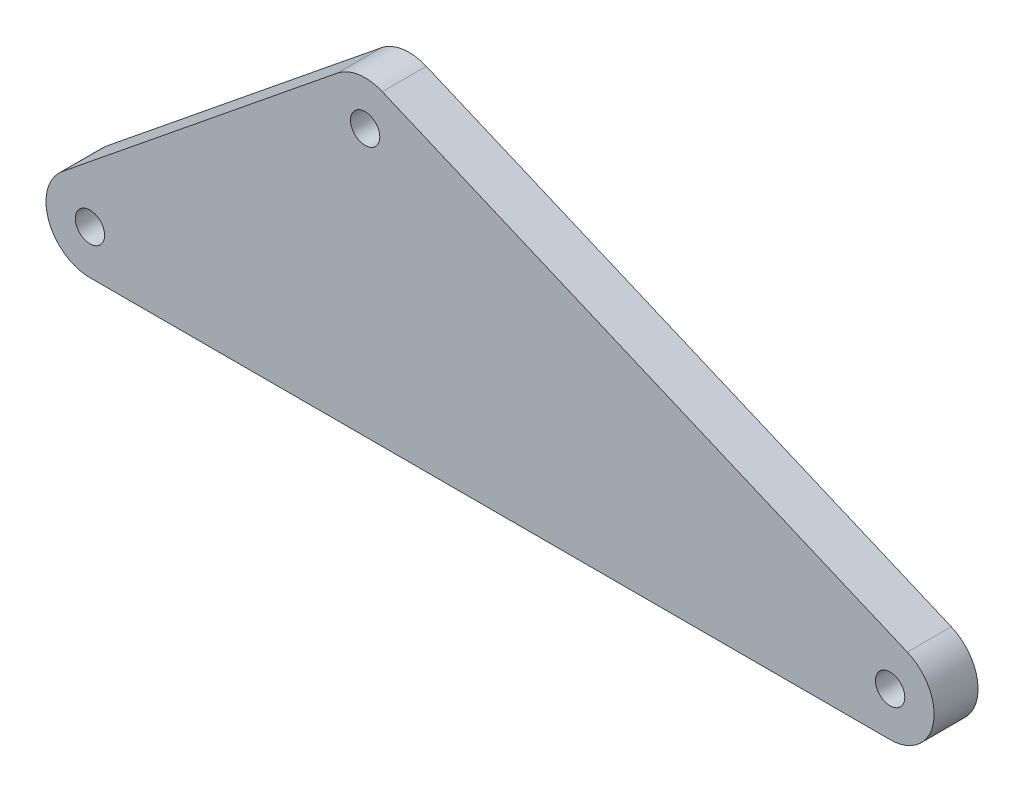
ISO-10303-21;
HEADER;
FILE_DESCRIPTION(('STEP AP214'),'2;1');
FILE_NAME('part.step','',(''),(''),'','','');
FILE_SCHEMA(('AUTOMOTIVE_DESIGN { 1 0 10303 214 1 1 1 1 }'));
ENDSEC;
DATA;
#1=APPLICATION_CONTEXT('core data for automotive mechanical design processes');
#2=APPLICATION_PROTOCOL_DEFINITION('international standard','automotive_design',2000,#1);
#3=PRODUCT_CONTEXT('',#1,'mechanical');
#4=PRODUCT('Part','Part','',(#3));
#5=PRODUCT_RELATED_PRODUCT_CATEGORY('part','',(#4));
#6=PRODUCT_DEFINITION_FORMATION('','',#4);
#7=PRODUCT_DEFINITION_CONTEXT('part definition',#1,'design');
#8=PRODUCT_DEFINITION('design','',#6,#7);
#9=PRODUCT_DEFINITION_SHAPE('','',#8);
#10=(LENGTH_UNIT() NAMED_UNIT(*) SI_UNIT(.MILLI.,.METRE.));
#11=(NAMED_UNIT(*) PLANE_ANGLE_UNIT() SI_UNIT($,.RADIAN.));
#12=(NAMED_UNIT(*) SI_UNIT($,.STERADIAN.) SOLID_ANGLE_UNIT());
#13=UNCERTAINTY_MEASURE_WITH_UNIT(LENGTH_MEASURE(1.E-05),#10,'distance_accuracy_value','');
#14=(GEOMETRIC_REPRESENTATION_CONTEXT(3) GLOBAL_UNCERTAINTY_ASSIGNED_CONTEXT((#13)) GLOBAL_UNIT_ASSIGNED_CONTEXT((#10,
#11,#12)) REPRESENTATION_CONTEXT('',''));
#15=CARTESIAN_POINT('',(0.,0.,0.));
#16=DIRECTION('',(0.,0.,1.));
#17=DIRECTION('',(1.,0.,0.));
#18=AXIS2_PLACEMENT_3D('',#15,#16,#17);
#19=CARTESIAN_POINT('',(-358.224761635496,152.05738985696,15.));
#20=DIRECTION('',(0.,0.,-1.));
#21=DIRECTION('',(-1.,0.,0.));
#22=AXIS2_PLACEMENT_3D('',#19,#20,#21);
#23=CYLINDRICAL_SURFACE('',#22,9.99999999999998);
#24=CARTESIAN_POINT('',(-358.224761635496,152.05738985696,15.));
#25=DIRECTION('',(0.,0.,1.));
#26=DIRECTION('',(1.,0.,0.));
#27=AXIS2_PLACEMENT_3D('',#24,#25,#26);
#28=CIRCLE('',#27,9.99999999999998);
#29=CARTESIAN_POINT('',(-348.224761635496,152.05738985696,15.));
#30=VERTEX_POINT('',#29);
#31=EDGE_CURVE('E126',#30,#30,#28,.T.);
#32=ORIENTED_EDGE('',*,*,#31,.T.);
#33=EDGE_LOOP('',(#32));
#34=FACE_BOUND('',#33,.T.);
#35=CARTESIAN_POINT('',(-358.224761635496,152.05738985696,-2.));
#36=DIRECTION('',(0.,0.,-1.));
#37=DIRECTION('',(-1.,0.,0.));
#38=AXIS2_PLACEMENT_3D('',#35,#36,#37);
#39=CIRCLE('',#38,9.99999999999998);
#40=CARTESIAN_POINT('',(-368.224761635496,152.05738985696,-2.));
#41=VERTEX_POINT('',#40);
#42=EDGE_CURVE('E39',#41,#41,#39,.T.);
#43=ORIENTED_EDGE('',*,*,#42,.T.);
#44=EDGE_LOOP('',(#43));
#45=FACE_BOUND('',#44,.T.);
#46=ADVANCED_FACE('F35',(#34,#45),#23,.F.);
#47=CARTESIAN_POINT('',(-358.224761635496,152.05738985696,15.));
#48=DIRECTION('',(0.,0.,-1.));
#49=DIRECTION('',(-1.,0.,0.));
#50=AXIS2_PLACEMENT_3D('',#47,#48,#49);
#51=PLANE('',#50);
#52=CARTESIAN_POINT('',(-358.224761635496,152.05738985696,15.));
#53=DIRECTION('',(0.,0.,1.));
#54=DIRECTION('',(-1.,0.,0.));
#55=AXIS2_PLACEMENT_3D('',#52,#53,#54);
#56=CIRCLE('',#55,30.);
#57=CARTESIAN_POINT('',(-346.502827780818,179.672535460533,15.));
#58=VERTEX_POINT('',#57);
#59=CARTESIAN_POINT('',(-377.104373366991,175.371768700669,15.));
#60=VERTEX_POINT('',#59);
#61=EDGE_CURVE('E133',#58,#60,#56,.T.);
#62=ORIENTED_EDGE('',*,*,#61,.T.);
#63=DIRECTION('',(-0.777145961456974,-0.629320391049833,0.));
#64=VECTOR('',#63,1.);
#65=CARTESIAN_POINT('',(-564.879611731495,23.3143788437092,15.));
#66=LINE('',#65,#64);
#67=CARTESIAN_POINT('',(-564.879611731495,23.3143788437093,15.));
#68=VERTEX_POINT('',#67);
#69=EDGE_CURVE('E90',#60,#68,#66,.T.);
#70=ORIENTED_EDGE('',*,*,#69,.T.);
#71=CARTESIAN_POINT('',(-546.,1.11022302462516E-13,15.));
#72=DIRECTION('',(0.,0.,1.));
#73=DIRECTION('',(-1.,0.,0.));
#74=AXIS2_PLACEMENT_3D('',#71,#72,#73);
#75=CIRCLE('',#74,29.9999999999999);
#76=CARTESIAN_POINT('',(-546.,-29.9999999999999,15.));
#77=VERTEX_POINT('',#76);
#78=EDGE_CURVE('E104',#68,#77,#75,.T.);
#79=ORIENTED_EDGE('',*,*,#78,.T.);
#80=DIRECTION('',(1.,0.,0.));
#81=VECTOR('',#80,1.);
#82=CARTESIAN_POINT('',(0.,-29.9999999999997,15.));
#83=LINE('',#82,#81);
#84=CARTESIAN_POINT('',(0.,-29.9999999999999,15.));
#85=VERTEX_POINT('',#84);
#86=EDGE_CURVE('E97',#77,#85,#83,.T.);
#87=ORIENTED_EDGE('',*,*,#86,.T.);
#88=CARTESIAN_POINT('',(0.,0.,15.));
#89=DIRECTION('',(0.,0.,1.));
#90=DIRECTION('',(-1.,0.,0.));
#91=AXIS2_PLACEMENT_3D('',#88,#89,#90);
#92=CIRCLE('',#91,29.9999999999999);
#93=CARTESIAN_POINT('',(11.7219338546786,27.6151456035733,15.));
#94=VERTEX_POINT('',#93);
#95=EDGE_CURVE('E102',#85,#94,#92,.T.);
#96=ORIENTED_EDGE('',*,*,#95,.T.);
#97=DIRECTION('',(-0.920504853452437,0.390731128489281,0.));
#98=VECTOR('',#97,1.);
#99=CARTESIAN_POINT('',(-346.502827780818,179.672535460533,15.));
#100=LINE('',#99,#98);
#101=EDGE_CURVE('E53',#94,#58,#100,.T.);
#102=ORIENTED_EDGE('',*,*,#101,.T.);
#103=EDGE_LOOP('',(#62,#70,#79,#87,#96,#102));
#104=FACE_BOUND('',#103,.T.);
#105=ORIENTED_EDGE('',*,*,#31,.F.);
#106=EDGE_LOOP('',(#105));
#107=FACE_BOUND('',#106,.T.);
#108=CARTESIAN_POINT('',(0.,0.,15.));
#109=DIRECTION('',(0.,0.,1.));
#110=DIRECTION('',(1.,0.,0.));
#111=AXIS2_PLACEMENT_3D('',#108,#109,#110);
#112=CIRCLE('',#111,9.99999999999998);
#113=CARTESIAN_POINT('',(9.99999999999998,0.,15.));
#114=VERTEX_POINT('',#113);
#115=EDGE_CURVE('E187',#114,#114,#112,.T.);
#116=ORIENTED_EDGE('',*,*,#115,.F.);
#117=EDGE_LOOP('',(#116));
#118=FACE_BOUND('',#117,.T.);
#119=CARTESIAN_POINT('',(-546.,1.11022302462516E-13,15.));
#120=DIRECTION('',(0.,0.,1.));
#121=DIRECTION('',(1.,0.,0.));
#122=AXIS2_PLACEMENT_3D('',#119,#120,#121);
#123=CIRCLE('',#122,9.99999999999998);
#124=CARTESIAN_POINT('',(-536.,1.11022302462516E-13,15.));
#125=VERTEX_POINT('',#124);
#126=EDGE_CURVE('E188',#125,#125,#123,.T.);
#127=ORIENTED_EDGE('',*,*,#126,.F.);
#128=EDGE_LOOP('',(#127));
#129=FACE_BOUND('',#128,.T.);
#130=ADVANCED_FACE('F99',(#104,#107,#118,#129),#51,.F.);
#131=CARTESIAN_POINT('',(-358.224761635496,152.05738985696,-15.));
#132=DIRECTION('',(0.,0.,-1.));
#133=DIRECTION('',(-1.,0.,0.));
#134=AXIS2_PLACEMENT_3D('',#131,#132,#133);
#135=PLANE('',#134);
#136=CARTESIAN_POINT('',(-358.224761635496,152.05738985696,-15.));
#137=DIRECTION('',(0.,0.,-1.));
#138=DIRECTION('',(-1.,0.,0.));
#139=AXIS2_PLACEMENT_3D('',#136,#137,#138);
#140=CIRCLE('',#139,20.);
#141=CARTESIAN_POINT('',(-378.224761635496,152.05738985696,-15.));
#142=VERTEX_POINT('',#141);
#143=EDGE_CURVE('E182',#142,#142,#140,.T.);
#144=ORIENTED_EDGE('',*,*,#143,.F.);
#145=EDGE_LOOP('',(#144));
#146=FACE_BOUND('',#145,.T.);
#147=CARTESIAN_POINT('',(0.,0.,-15.));
#148=DIRECTION('',(0.,0.,1.));
#149=DIRECTION('',(1.,0.,0.));
#150=AXIS2_PLACEMENT_3D('',#147,#148,#149);
#151=CIRCLE('',#150,9.99999999999998);
#152=CARTESIAN_POINT('',(9.99999999999998,0.,-15.));
#153=VERTEX_POINT('',#152);
#154=EDGE_CURVE('E185',#153,#153,#151,.T.);
#155=ORIENTED_EDGE('',*,*,#154,.T.);
#156=EDGE_LOOP('',(#155));
#157=FACE_BOUND('',#156,.T.);
#158=CARTESIAN_POINT('',(-358.224761635496,152.05738985696,-15.));
#159=DIRECTION('',(0.,0.,1.));
#160=DIRECTION('',(-1.,0.,0.));
#161=AXIS2_PLACEMENT_3D('',#158,#159,#160);
#162=CIRCLE('',#161,30.);
#163=CARTESIAN_POINT('',(-346.502827780818,179.672535460533,-15.));
#164=VERTEX_POINT('',#163);
#165=CARTESIAN_POINT('',(-377.104373366991,175.371768700669,-15.));
#166=VERTEX_POINT('',#165);
#167=EDGE_CURVE('E122',#164,#166,#162,.T.);
#168=ORIENTED_EDGE('',*,*,#167,.F.);
#169=DIRECTION('',(-0.920504853452437,0.390731128489281,0.));
#170=VECTOR('',#169,1.);
#171=CARTESIAN_POINT('',(-346.502827780818,179.672535460533,-15.));
#172=LINE('',#171,#170);
#173=CARTESIAN_POINT('',(11.7219338546786,27.6151456035733,-15.));
#174=VERTEX_POINT('',#173);
#175=EDGE_CURVE('E82',#174,#164,#172,.T.);
#176=ORIENTED_EDGE('',*,*,#175,.F.);
#177=CARTESIAN_POINT('',(0.,0.,-15.));
#178=DIRECTION('',(0.,0.,1.));
#179=DIRECTION('',(-1.,0.,0.));
#180=AXIS2_PLACEMENT_3D('',#177,#178,#179);
#181=CIRCLE('',#180,29.9999999999999);
#182=CARTESIAN_POINT('',(0.,-29.9999999999999,-15.));
#183=VERTEX_POINT('',#182);
#184=EDGE_CURVE('E76',#183,#174,#181,.T.);
#185=ORIENTED_EDGE('',*,*,#184,.F.);
#186=DIRECTION('',(1.,0.,0.));
#187=VECTOR('',#186,1.);
#188=CARTESIAN_POINT('',(0.,-29.9999999999997,-15.));
#189=LINE('',#188,#187);
#190=CARTESIAN_POINT('',(-546.,-29.9999999999999,-15.));
#191=VERTEX_POINT('',#190);
#192=EDGE_CURVE('E112',#191,#183,#189,.T.);
#193=ORIENTED_EDGE('',*,*,#192,.F.);
#194=CARTESIAN_POINT('',(-546.,1.11022302462516E-13,-15.));
#195=DIRECTION('',(0.,0.,1.));
#196=DIRECTION('',(-1.,0.,0.));
#197=AXIS2_PLACEMENT_3D('',#194,#195,#196);
#198=CIRCLE('',#197,29.9999999999999);
#199=CARTESIAN_POINT('',(-564.879611731495,23.3143788437093,-15.));
#200=VERTEX_POINT('',#199);
#201=EDGE_CURVE('E128',#200,#191,#198,.T.);
#202=ORIENTED_EDGE('',*,*,#201,.F.);
#203=DIRECTION('',(-0.777145961456974,-0.629320391049833,0.));
#204=VECTOR('',#203,1.);
#205=CARTESIAN_POINT('',(-564.879611731495,23.3143788437092,-15.));
#206=LINE('',#205,#204);
#207=EDGE_CURVE('E125',#166,#200,#206,.T.);
#208=ORIENTED_EDGE('',*,*,#207,.F.);
#209=EDGE_LOOP('',(#168,#176,#185,#193,#202,#208));
#210=FACE_BOUND('',#209,.T.);
#211=CARTESIAN_POINT('',(-546.,1.11022302462516E-13,-15.));
#212=DIRECTION('',(0.,0.,1.));
#213=DIRECTION('',(1.,0.,0.));
#214=AXIS2_PLACEMENT_3D('',#211,#212,#213);
#215=CIRCLE('',#214,9.99999999999998);
#216=CARTESIAN_POINT('',(-536.,1.11022302462516E-13,-15.));
#217=VERTEX_POINT('',#216);
#218=EDGE_CURVE('E193',#217,#217,#215,.T.);
#219=ORIENTED_EDGE('',*,*,#218,.T.);
#220=EDGE_LOOP('',(#219));
#221=FACE_BOUND('',#220,.T.);
#222=ADVANCED_FACE('F143',(#146,#157,#210,#221),#135,.T.);
#223=CARTESIAN_POINT('',(-358.224761635496,152.05738985696,15.));
#224=DIRECTION('',(0.,0.,-1.));
#225=DIRECTION('',(-1.,0.,0.));
#226=AXIS2_PLACEMENT_3D('',#223,#224,#225);
#227=CYLINDRICAL_SURFACE('',#226,30.);
#228=ORIENTED_EDGE('',*,*,#167,.T.);
#229=DIRECTION('',(0.,0.,-1.));
#230=VECTOR('',#229,1.);
#231=CARTESIAN_POINT('',(-377.104373366991,175.371768700669,15.));
#232=LINE('',#231,#230);
#233=EDGE_CURVE('E11',#60,#166,#232,.T.);
#234=ORIENTED_EDGE('',*,*,#233,.F.);
#235=ORIENTED_EDGE('',*,*,#61,.F.);
#236=DIRECTION('',(0.,0.,-1.));
#237=VECTOR('',#236,1.);
#238=CARTESIAN_POINT('',(-346.502827780818,179.672535460533,15.));
#239=LINE('',#238,#237);
#240=EDGE_CURVE('E118',#58,#164,#239,.T.);
#241=ORIENTED_EDGE('',*,*,#240,.T.);
#242=EDGE_LOOP('',(#228,#234,#235,#241));
#243=FACE_BOUND('',#242,.T.);
#244=ADVANCED_FACE('F37',(#243),#227,.T.);
#245=CARTESIAN_POINT('',(-564.879611731495,23.3143788437092,15.));
#246=DIRECTION('',(0.629320391049833,-0.777145961456974,0.));
#247=DIRECTION('',(0.777145961456974,0.629320391049833,0.));
#248=AXIS2_PLACEMENT_3D('',#245,#246,#247);
#249=PLANE('',#248);
#250=ORIENTED_EDGE('',*,*,#207,.T.);
#251=DIRECTION('',(0.,0.,-1.));
#252=VECTOR('',#251,1.);
#253=CARTESIAN_POINT('',(-564.879611731495,23.3143788437093,15.));
#254=LINE('',#253,#252);
#255=EDGE_CURVE('E45',#68,#200,#254,.T.);
#256=ORIENTED_EDGE('',*,*,#255,.F.);
#257=ORIENTED_EDGE('',*,*,#69,.F.);
#258=ORIENTED_EDGE('',*,*,#233,.T.);
#259=EDGE_LOOP('',(#250,#256,#257,#258));
#260=FACE_BOUND('',#259,.T.);
#261=ADVANCED_FACE('F178',(#260),#249,.F.);
#262=CARTESIAN_POINT('',(-546.,1.11022302462516E-13,15.));
#263=DIRECTION('',(0.,0.,-1.));
#264=DIRECTION('',(-1.,0.,0.));
#265=AXIS2_PLACEMENT_3D('',#262,#263,#264);
#266=CYLINDRICAL_SURFACE('',#265,29.9999999999999);
#267=ORIENTED_EDGE('',*,*,#201,.T.);
#268=DIRECTION('',(0.,0.,-1.));
#269=VECTOR('',#268,1.);
#270=CARTESIAN_POINT('',(-546.,-29.9999999999999,15.));
#271=LINE('',#270,#269);
#272=EDGE_CURVE('E113',#77,#191,#271,.T.);
#273=ORIENTED_EDGE('',*,*,#272,.F.);
#274=ORIENTED_EDGE('',*,*,#78,.F.);
#275=ORIENTED_EDGE('',*,*,#255,.T.);
#276=EDGE_LOOP('',(#267,#273,#274,#275));
#277=FACE_BOUND('',#276,.T.);
#278=ADVANCED_FACE('F140',(#277),#266,.T.);
#279=CARTESIAN_POINT('',(0.,-29.9999999999997,15.));
#280=DIRECTION('',(0.,1.,0.));
#281=DIRECTION('',(-1.,0.,0.));
#282=AXIS2_PLACEMENT_3D('',#279,#280,#281);
#283=PLANE('',#282);
#284=ORIENTED_EDGE('',*,*,#192,.T.);
#285=DIRECTION('',(0.,0.,-1.));
#286=VECTOR('',#285,1.);
#287=CARTESIAN_POINT('',(0.,-29.9999999999999,15.));
#288=LINE('',#287,#286);
#289=EDGE_CURVE('E109',#85,#183,#288,.T.);
#290=ORIENTED_EDGE('',*,*,#289,.F.);
#291=ORIENTED_EDGE('',*,*,#86,.F.);
#292=ORIENTED_EDGE('',*,*,#272,.T.);
#293=EDGE_LOOP('',(#284,#290,#291,#292));
#294=FACE_BOUND('',#293,.T.);
#295=ADVANCED_FACE('F110',(#294),#283,.F.);
#296=CARTESIAN_POINT('',(0.,0.,15.));
#297=DIRECTION('',(0.,0.,-1.));
#298=DIRECTION('',(-1.,0.,0.));
#299=AXIS2_PLACEMENT_3D('',#296,#297,#298);
#300=CYLINDRICAL_SURFACE('',#299,29.9999999999999);
#301=ORIENTED_EDGE('',*,*,#184,.T.);
#302=DIRECTION('',(0.,0.,-1.));
#303=VECTOR('',#302,1.);
#304=CARTESIAN_POINT('',(11.7219338546786,27.6151456035733,15.));
#305=LINE('',#304,#303);
#306=EDGE_CURVE('E114',#94,#174,#305,.T.);
#307=ORIENTED_EDGE('',*,*,#306,.F.);
#308=ORIENTED_EDGE('',*,*,#95,.F.);
#309=ORIENTED_EDGE('',*,*,#289,.T.);
#310=EDGE_LOOP('',(#301,#307,#308,#309));
#311=FACE_BOUND('',#310,.T.);
#312=ADVANCED_FACE('F116',(#311),#300,.T.);
#313=CARTESIAN_POINT('',(-346.502827780818,179.672535460533,15.));
#314=DIRECTION('',(-0.390731128489281,-0.920504853452437,0.));
#315=DIRECTION('',(0.920504853452437,-0.390731128489281,0.));
#316=AXIS2_PLACEMENT_3D('',#313,#314,#315);
#317=PLANE('',#316);
#318=ORIENTED_EDGE('',*,*,#175,.T.);
#319=ORIENTED_EDGE('',*,*,#240,.F.);
#320=ORIENTED_EDGE('',*,*,#101,.F.);
#321=ORIENTED_EDGE('',*,*,#306,.T.);
#322=EDGE_LOOP('',(#318,#319,#320,#321));
#323=FACE_BOUND('',#322,.T.);
#324=ADVANCED_FACE('F148',(#323),#317,.F.);
#325=CARTESIAN_POINT('',(0.,0.,15.));
#326=DIRECTION('',(0.,0.,-1.));
#327=DIRECTION('',(-1.,0.,0.));
#328=AXIS2_PLACEMENT_3D('',#325,#326,#327);
#329=CYLINDRICAL_SURFACE('',#328,9.99999999999998);
#330=ORIENTED_EDGE('',*,*,#115,.T.);
#331=EDGE_LOOP('',(#330));
#332=FACE_BOUND('',#331,.T.);
#333=ORIENTED_EDGE('',*,*,#154,.F.);
#334=EDGE_LOOP('',(#333));
#335=FACE_BOUND('',#334,.T.);
#336=ADVANCED_FACE('F150',(#332,#335),#329,.F.);
#337=CARTESIAN_POINT('',(-546.,1.11022302462516E-13,15.));
#338=DIRECTION('',(0.,0.,-1.));
#339=DIRECTION('',(-1.,0.,0.));
#340=AXIS2_PLACEMENT_3D('',#337,#338,#339);
#341=CYLINDRICAL_SURFACE('',#340,9.99999999999998);
#342=ORIENTED_EDGE('',*,*,#126,.T.);
#343=EDGE_LOOP('',(#342));
#344=FACE_BOUND('',#343,.T.);
#345=ORIENTED_EDGE('',*,*,#218,.F.);
#346=EDGE_LOOP('',(#345));
#347=FACE_BOUND('',#346,.T.);
#348=ADVANCED_FACE('F156',(#344,#347),#341,.F.);
#349=CARTESIAN_POINT('',(-358.224761635496,152.05738985696,-2.));
#350=DIRECTION('',(0.,0.,-1.));
#351=DIRECTION('',(-1.,0.,0.));
#352=AXIS2_PLACEMENT_3D('',#349,#350,#351);
#353=CYLINDRICAL_SURFACE('',#352,20.);
#354=CARTESIAN_POINT('',(-358.224761635496,152.05738985696,-2.));
#355=DIRECTION('',(0.,0.,-1.));
#356=DIRECTION('',(-1.,0.,0.));
#357=AXIS2_PLACEMENT_3D('',#354,#355,#356);
#358=CIRCLE('',#357,20.);
#359=CARTESIAN_POINT('',(-378.224761635496,152.05738985696,-2.));
#360=VERTEX_POINT('',#359);
#361=EDGE_CURVE('E211',#360,#360,#358,.T.);
#362=ORIENTED_EDGE('',*,*,#361,.F.);
#363=EDGE_LOOP('',(#362));
#364=FACE_BOUND('',#363,.T.);
#365=ORIENTED_EDGE('',*,*,#143,.T.);
#366=EDGE_LOOP('',(#365));
#367=FACE_BOUND('',#366,.T.);
#368=ADVANCED_FACE('F207',(#364,#367),#353,.F.);
#369=CARTESIAN_POINT('',(-358.224761635496,152.05738985696,-2.));
#370=DIRECTION('',(0.,0.,-1.));
#371=DIRECTION('',(-1.,0.,0.));
#372=AXIS2_PLACEMENT_3D('',#369,#370,#371);
#373=PLANE('',#372);
#374=ORIENTED_EDGE('',*,*,#42,.F.);
#375=EDGE_LOOP('',(#374));
#376=FACE_BOUND('',#375,.T.);
#377=ORIENTED_EDGE('',*,*,#361,.T.);
#378=EDGE_LOOP('',(#377));
#379=FACE_BOUND('',#378,.T.);
#380=ADVANCED_FACE('F217',(#376,#379),#373,.T.);
#381=CLOSED_SHELL('',(#46,#130,#222,#244,#261,#278,#295,#312,#324,#336,#348,#368,#380));
#382=MANIFOLD_SOLID_BREP('B2',#381);
#383=ADVANCED_BREP_SHAPE_REPRESENTATION('',(#18,#382),#14);
#384=SHAPE_DEFINITION_REPRESENTATION(#9,#383);
ENDSEC;
END-ISO-10303-21;
